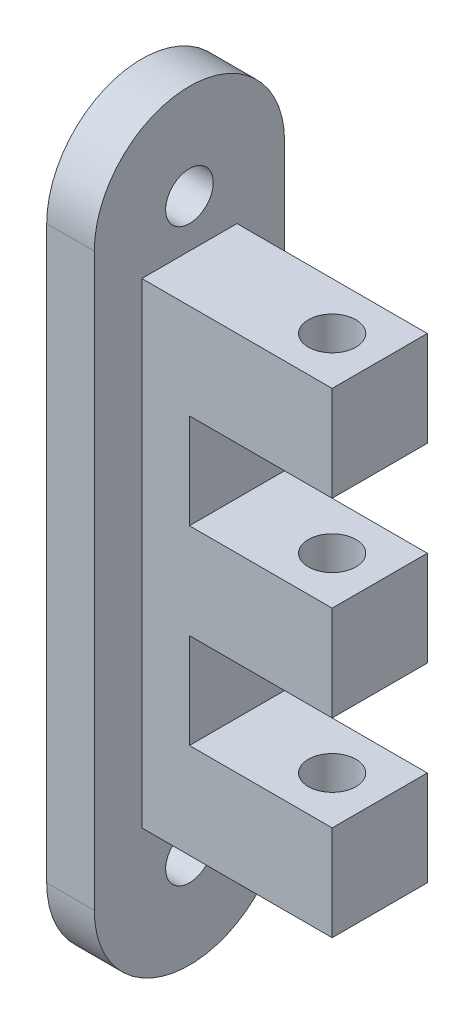
ISO-10303-21;
HEADER;
FILE_DESCRIPTION(('STEP AP214'),'2;1');
FILE_NAME('part.step','',(''),(''),'','','');
FILE_SCHEMA(('AUTOMOTIVE_DESIGN { 1 0 10303 214 1 1 1 1 }'));
ENDSEC;
DATA;
#1=APPLICATION_CONTEXT('core data for automotive mechanical design processes');
#2=APPLICATION_PROTOCOL_DEFINITION('international standard','automotive_design',2000,#1);
#3=PRODUCT_CONTEXT('',#1,'mechanical');
#4=PRODUCT('Part','Part','',(#3));
#5=PRODUCT_RELATED_PRODUCT_CATEGORY('part','',(#4));
#6=PRODUCT_DEFINITION_FORMATION('','',#4);
#7=PRODUCT_DEFINITION_CONTEXT('part definition',#1,'design');
#8=PRODUCT_DEFINITION('design','',#6,#7);
#9=PRODUCT_DEFINITION_SHAPE('','',#8);
#10=(LENGTH_UNIT() NAMED_UNIT(*) SI_UNIT(.MILLI.,.METRE.));
#11=(NAMED_UNIT(*) PLANE_ANGLE_UNIT() SI_UNIT($,.RADIAN.));
#12=(NAMED_UNIT(*) SI_UNIT($,.STERADIAN.) SOLID_ANGLE_UNIT());
#13=UNCERTAINTY_MEASURE_WITH_UNIT(LENGTH_MEASURE(1.E-05),#10,'distance_accuracy_value','');
#14=(GEOMETRIC_REPRESENTATION_CONTEXT(3) GLOBAL_UNCERTAINTY_ASSIGNED_CONTEXT((#13)) GLOBAL_UNIT_ASSIGNED_CONTEXT((#10,
#11,#12)) REPRESENTATION_CONTEXT('',''));
#15=CARTESIAN_POINT('',(0.,0.,0.));
#16=DIRECTION('',(0.,0.,1.));
#17=DIRECTION('',(1.,0.,0.));
#18=AXIS2_PLACEMENT_3D('',#15,#16,#17);
#19=CARTESIAN_POINT('',(0.,80.,-20.));
#20=DIRECTION('',(-1.,0.,0.));
#21=DIRECTION('',(0.,-1.,0.));
#22=AXIS2_PLACEMENT_3D('',#19,#20,#21);
#23=PLANE('',#22);
#24=DIRECTION('',(0.,-1.,0.));
#25=VECTOR('',#24,1.);
#26=CARTESIAN_POINT('',(0.,80.,20.));
#27=LINE('',#26,#25);
#28=CARTESIAN_POINT('',(0.,60.,20.));
#29=VERTEX_POINT('',#28);
#30=CARTESIAN_POINT('',(0.,-60.,20.));
#31=VERTEX_POINT('',#30);
#32=EDGE_CURVE('E177',#29,#31,#27,.T.);
#33=ORIENTED_EDGE('',*,*,#32,.T.);
#34=CARTESIAN_POINT('',(0.,-60.,0.));
#35=DIRECTION('',(-1.,0.,0.));
#36=DIRECTION('',(0.,-1.,0.));
#37=AXIS2_PLACEMENT_3D('',#34,#35,#36);
#38=CIRCLE('',#37,20.);
#39=CARTESIAN_POINT('',(0.,-60.,-20.));
#40=VERTEX_POINT('',#39);
#41=EDGE_CURVE('E11',#31,#40,#38,.F.);
#42=ORIENTED_EDGE('',*,*,#41,.T.);
#43=DIRECTION('',(0.,-1.,0.));
#44=VECTOR('',#43,1.);
#45=CARTESIAN_POINT('',(0.,80.,-20.));
#46=LINE('',#45,#44);
#47=CARTESIAN_POINT('',(0.,60.,-20.));
#48=VERTEX_POINT('',#47);
#49=EDGE_CURVE('E180',#48,#40,#46,.T.);
#50=ORIENTED_EDGE('',*,*,#49,.F.);
#51=CARTESIAN_POINT('',(0.,60.,0.));
#52=DIRECTION('',(-1.,0.,0.));
#53=DIRECTION('',(0.,-1.,0.));
#54=AXIS2_PLACEMENT_3D('',#51,#52,#53);
#55=CIRCLE('',#54,20.);
#56=EDGE_CURVE('E194',#48,#29,#55,.F.);
#57=ORIENTED_EDGE('',*,*,#56,.T.);
#58=EDGE_LOOP('',(#33,#42,#50,#57));
#59=FACE_BOUND('',#58,.T.);
#60=CARTESIAN_POINT('',(0.,60.,0.));
#61=DIRECTION('',(1.,0.,0.));
#62=DIRECTION('',(0.,1.,0.));
#63=AXIS2_PLACEMENT_3D('',#60,#61,#62);
#64=CIRCLE('',#63,5.);
#65=CARTESIAN_POINT('',(0.,65.,0.));
#66=VERTEX_POINT('',#65);
#67=EDGE_CURVE('E172',#66,#66,#64,.T.);
#68=ORIENTED_EDGE('',*,*,#67,.F.);
#69=EDGE_LOOP('',(#68));
#70=FACE_BOUND('',#69,.T.);
#71=CARTESIAN_POINT('',(0.,-60.,0.));
#72=DIRECTION('',(1.,0.,0.));
#73=DIRECTION('',(0.,1.,0.));
#74=AXIS2_PLACEMENT_3D('',#71,#72,#73);
#75=CIRCLE('',#74,5.);
#76=CARTESIAN_POINT('',(0.,-55.,0.));
#77=VERTEX_POINT('',#76);
#78=EDGE_CURVE('E162',#77,#77,#75,.T.);
#79=ORIENTED_EDGE('',*,*,#78,.F.);
#80=EDGE_LOOP('',(#79));
#81=FACE_BOUND('',#80,.T.);
#82=DIRECTION('',(0.,-1.,0.));
#83=VECTOR('',#82,1.);
#84=CARTESIAN_POINT('',(0.,-50.,10.));
#85=LINE('',#84,#83);
#86=CARTESIAN_POINT('',(0.,50.,10.));
#87=VERTEX_POINT('',#86);
#88=CARTESIAN_POINT('',(0.,-50.,10.));
#89=VERTEX_POINT('',#88);
#90=EDGE_CURVE('E148',#87,#89,#85,.T.);
#91=ORIENTED_EDGE('',*,*,#90,.F.);
#92=DIRECTION('',(0.,0.,-1.));
#93=VECTOR('',#92,1.);
#94=CARTESIAN_POINT('',(0.,50.,10.));
#95=LINE('',#94,#93);
#96=CARTESIAN_POINT('',(0.,50.,-10.));
#97=VERTEX_POINT('',#96);
#98=EDGE_CURVE('E449',#87,#97,#95,.T.);
#99=ORIENTED_EDGE('',*,*,#98,.T.);
#100=DIRECTION('',(0.,-1.,0.));
#101=VECTOR('',#100,1.);
#102=CARTESIAN_POINT('',(0.,-50.,-10.));
#103=LINE('',#102,#101);
#104=CARTESIAN_POINT('',(0.,-50.,-10.));
#105=VERTEX_POINT('',#104);
#106=EDGE_CURVE('E161',#97,#105,#103,.T.);
#107=ORIENTED_EDGE('',*,*,#106,.T.);
#108=DIRECTION('',(0.,0.,-1.));
#109=VECTOR('',#108,1.);
#110=CARTESIAN_POINT('',(0.,-50.,10.));
#111=LINE('',#110,#109);
#112=EDGE_CURVE('E45',#89,#105,#111,.T.);
#113=ORIENTED_EDGE('',*,*,#112,.F.);
#114=EDGE_LOOP('',(#91,#99,#107,#113));
#115=FACE_BOUND('',#114,.T.);
#116=ADVANCED_FACE('F30',(#59,#70,#81,#115),#23,.F.);
#117=CARTESIAN_POINT('',(-10.,-60.,0.));
#118=DIRECTION('',(-1.,0.,0.));
#119=DIRECTION('',(0.,-1.,0.));
#120=AXIS2_PLACEMENT_3D('',#117,#118,#119);
#121=CYLINDRICAL_SURFACE('',#120,20.);
#122=DIRECTION('',(-1.,0.,0.));
#123=VECTOR('',#122,1.);
#124=CARTESIAN_POINT('',(0.,-60.,20.));
#125=LINE('',#124,#123);
#126=CARTESIAN_POINT('',(-10.,-60.,20.));
#127=VERTEX_POINT('',#126);
#128=EDGE_CURVE('E199',#127,#31,#125,.F.);
#129=ORIENTED_EDGE('',*,*,#128,.F.);
#130=CARTESIAN_POINT('',(-10.,-60.,0.));
#131=DIRECTION('',(1.,0.,0.));
#132=DIRECTION('',(0.,1.,0.));
#133=AXIS2_PLACEMENT_3D('',#130,#131,#132);
#134=CIRCLE('',#133,20.);
#135=CARTESIAN_POINT('',(-10.,-60.,-20.));
#136=VERTEX_POINT('',#135);
#137=EDGE_CURVE('E38',#136,#127,#134,.F.);
#138=ORIENTED_EDGE('',*,*,#137,.F.);
#139=DIRECTION('',(1.,0.,0.));
#140=VECTOR('',#139,1.);
#141=CARTESIAN_POINT('',(-10.,-60.,-20.));
#142=LINE('',#141,#140);
#143=EDGE_CURVE('E202',#40,#136,#142,.F.);
#144=ORIENTED_EDGE('',*,*,#143,.F.);
#145=ORIENTED_EDGE('',*,*,#41,.F.);
#146=EDGE_LOOP('',(#129,#138,#144,#145));
#147=FACE_BOUND('',#146,.T.);
#148=ADVANCED_FACE('F32',(#147),#121,.T.);
#149=CARTESIAN_POINT('',(0.,60.,0.));
#150=DIRECTION('',(1.,0.,0.));
#151=DIRECTION('',(0.,1.,0.));
#152=AXIS2_PLACEMENT_3D('',#149,#150,#151);
#153=CYLINDRICAL_SURFACE('',#152,20.);
#154=DIRECTION('',(1.,0.,0.));
#155=VECTOR('',#154,1.);
#156=CARTESIAN_POINT('',(1.76365635428265E-13,60.,20.));
#157=LINE('',#156,#155);
#158=CARTESIAN_POINT('',(-9.99999999999997,60.,20.));
#159=VERTEX_POINT('',#158);
#160=EDGE_CURVE('E186',#29,#159,#157,.F.);
#161=ORIENTED_EDGE('',*,*,#160,.F.);
#162=ORIENTED_EDGE('',*,*,#56,.F.);
#163=DIRECTION('',(-1.,0.,0.));
#164=VECTOR('',#163,1.);
#165=CARTESIAN_POINT('',(0.,60.,-20.));
#166=LINE('',#165,#164);
#167=CARTESIAN_POINT('',(-9.99999999999997,60.,-20.));
#168=VERTEX_POINT('',#167);
#169=EDGE_CURVE('E191',#168,#48,#166,.F.);
#170=ORIENTED_EDGE('',*,*,#169,.F.);
#171=CARTESIAN_POINT('',(-9.99999999999998,60.,0.));
#172=DIRECTION('',(1.,0.,0.));
#173=DIRECTION('',(0.,1.,0.));
#174=AXIS2_PLACEMENT_3D('',#171,#172,#173);
#175=CIRCLE('',#174,20.);
#176=EDGE_CURVE('E196',#159,#168,#175,.F.);
#177=ORIENTED_EDGE('',*,*,#176,.F.);
#178=EDGE_LOOP('',(#161,#162,#170,#177));
#179=FACE_BOUND('',#178,.T.);
#180=ADVANCED_FACE('F216',(#179),#153,.T.);
#181=CARTESIAN_POINT('',(-9.99999999999997,80.,-20.));
#182=DIRECTION('',(1.,0.,0.));
#183=DIRECTION('',(0.,1.,0.));
#184=AXIS2_PLACEMENT_3D('',#181,#182,#183);
#185=PLANE('',#184);
#186=CARTESIAN_POINT('',(-10.0000000000001,-60.,0.));
#187=DIRECTION('',(1.,0.,0.));
#188=DIRECTION('',(0.,1.,0.));
#189=AXIS2_PLACEMENT_3D('',#186,#187,#188);
#190=CIRCLE('',#189,5.);
#191=CARTESIAN_POINT('',(-10.0000000000001,-55.,0.));
#192=VERTEX_POINT('',#191);
#193=EDGE_CURVE('E165',#192,#192,#190,.T.);
#194=ORIENTED_EDGE('',*,*,#193,.T.);
#195=EDGE_LOOP('',(#194));
#196=FACE_BOUND('',#195,.T.);
#197=CARTESIAN_POINT('',(-10.,60.,0.));
#198=DIRECTION('',(1.,0.,0.));
#199=DIRECTION('',(0.,1.,0.));
#200=AXIS2_PLACEMENT_3D('',#197,#198,#199);
#201=CIRCLE('',#200,5.);
#202=CARTESIAN_POINT('',(-10.,65.,0.));
#203=VERTEX_POINT('',#202);
#204=EDGE_CURVE('E174',#203,#203,#201,.T.);
#205=ORIENTED_EDGE('',*,*,#204,.T.);
#206=EDGE_LOOP('',(#205));
#207=FACE_BOUND('',#206,.T.);
#208=DIRECTION('',(0.,1.,0.));
#209=VECTOR('',#208,1.);
#210=CARTESIAN_POINT('',(-9.99999999999997,80.,-20.));
#211=LINE('',#210,#209);
#212=EDGE_CURVE('E183',#136,#168,#211,.T.);
#213=ORIENTED_EDGE('',*,*,#212,.F.);
#214=ORIENTED_EDGE('',*,*,#137,.T.);
#215=DIRECTION('',(0.,1.,0.));
#216=VECTOR('',#215,1.);
#217=CARTESIAN_POINT('',(-9.99999999999997,80.,20.));
#218=LINE('',#217,#216);
#219=EDGE_CURVE('E184',#127,#159,#218,.T.);
#220=ORIENTED_EDGE('',*,*,#219,.T.);
#221=ORIENTED_EDGE('',*,*,#176,.T.);
#222=EDGE_LOOP('',(#213,#214,#220,#221));
#223=FACE_BOUND('',#222,.T.);
#224=ADVANCED_FACE('F207',(#196,#207,#223),#185,.F.);
#225=CARTESIAN_POINT('',(0.,-80.,-20.));
#226=DIRECTION('',(0.,0.,-1.));
#227=DIRECTION('',(-1.,0.,0.));
#228=AXIS2_PLACEMENT_3D('',#225,#226,#227);
#229=PLANE('',#228);
#230=ORIENTED_EDGE('',*,*,#49,.T.);
#231=ORIENTED_EDGE('',*,*,#143,.T.);
#232=ORIENTED_EDGE('',*,*,#212,.T.);
#233=ORIENTED_EDGE('',*,*,#169,.T.);
#234=EDGE_LOOP('',(#230,#231,#232,#233));
#235=FACE_BOUND('',#234,.T.);
#236=ADVANCED_FACE('F219',(#235),#229,.T.);
#237=CARTESIAN_POINT('',(0.,-80.,20.));
#238=DIRECTION('',(0.,0.,-1.));
#239=DIRECTION('',(-1.,0.,0.));
#240=AXIS2_PLACEMENT_3D('',#237,#238,#239);
#241=PLANE('',#240);
#242=ORIENTED_EDGE('',*,*,#219,.F.);
#243=ORIENTED_EDGE('',*,*,#128,.T.);
#244=ORIENTED_EDGE('',*,*,#32,.F.);
#245=ORIENTED_EDGE('',*,*,#160,.T.);
#246=EDGE_LOOP('',(#242,#243,#244,#245));
#247=FACE_BOUND('',#246,.T.);
#248=ADVANCED_FACE('F213',(#247),#241,.F.);
#249=CARTESIAN_POINT('',(-10.,60.,0.));
#250=DIRECTION('',(1.,0.,0.));
#251=DIRECTION('',(0.,1.,0.));
#252=AXIS2_PLACEMENT_3D('',#249,#250,#251);
#253=CYLINDRICAL_SURFACE('',#252,5.);
#254=ORIENTED_EDGE('',*,*,#204,.F.);
#255=EDGE_LOOP('',(#254));
#256=FACE_BOUND('',#255,.T.);
#257=ORIENTED_EDGE('',*,*,#67,.T.);
#258=EDGE_LOOP('',(#257));
#259=FACE_BOUND('',#258,.T.);
#260=ADVANCED_FACE('F229',(#256,#259),#253,.F.);
#261=CARTESIAN_POINT('',(-10.0000000000001,-60.,0.));
#262=DIRECTION('',(1.,0.,0.));
#263=DIRECTION('',(0.,1.,0.));
#264=AXIS2_PLACEMENT_3D('',#261,#262,#263);
#265=CYLINDRICAL_SURFACE('',#264,5.);
#266=ORIENTED_EDGE('',*,*,#193,.F.);
#267=EDGE_LOOP('',(#266));
#268=FACE_BOUND('',#267,.T.);
#269=ORIENTED_EDGE('',*,*,#78,.T.);
#270=EDGE_LOOP('',(#269));
#271=FACE_BOUND('',#270,.T.);
#272=ADVANCED_FACE('F227',(#268,#271),#265,.F.);
#273=CARTESIAN_POINT('',(0.,-50.,10.));
#274=DIRECTION('',(0.,1.,0.));
#275=DIRECTION('',(0.,0.,1.));
#276=AXIS2_PLACEMENT_3D('',#273,#274,#275);
#277=PLANE('',#276);
#278=CARTESIAN_POINT('',(30.,-50.,0.));
#279=DIRECTION('',(0.,1.,0.));
#280=DIRECTION('',(0.,0.,1.));
#281=AXIS2_PLACEMENT_3D('',#278,#279,#280);
#282=CIRCLE('',#281,5.);
#283=CARTESIAN_POINT('',(30.,-50.,5.));
#284=VERTEX_POINT('',#283);
#285=EDGE_CURVE('E424',#284,#284,#282,.T.);
#286=ORIENTED_EDGE('',*,*,#285,.T.);
#287=EDGE_LOOP('',(#286));
#288=FACE_BOUND('',#287,.T.);
#289=DIRECTION('',(1.,0.,0.));
#290=VECTOR('',#289,1.);
#291=CARTESIAN_POINT('',(0.,-50.,-10.));
#292=LINE('',#291,#290);
#293=CARTESIAN_POINT('',(40.,-50.,-10.));
#294=VERTEX_POINT('',#293);
#295=EDGE_CURVE('E426',#105,#294,#292,.T.);
#296=ORIENTED_EDGE('',*,*,#295,.T.);
#297=DIRECTION('',(0.,0.,-1.));
#298=VECTOR('',#297,1.);
#299=CARTESIAN_POINT('',(40.,-50.,10.));
#300=LINE('',#299,#298);
#301=CARTESIAN_POINT('',(40.,-50.,10.));
#302=VERTEX_POINT('',#301);
#303=EDGE_CURVE('E144',#302,#294,#300,.T.);
#304=ORIENTED_EDGE('',*,*,#303,.F.);
#305=DIRECTION('',(1.,0.,0.));
#306=VECTOR('',#305,1.);
#307=CARTESIAN_POINT('',(0.,-50.,10.));
#308=LINE('',#307,#306);
#309=EDGE_CURVE('E140',#89,#302,#308,.T.);
#310=ORIENTED_EDGE('',*,*,#309,.F.);
#311=ORIENTED_EDGE('',*,*,#112,.T.);
#312=EDGE_LOOP('',(#296,#304,#310,#311));
#313=FACE_BOUND('',#312,.T.);
#314=ADVANCED_FACE('F142',(#288,#313),#277,.F.);
#315=CARTESIAN_POINT('',(40.,-50.,10.));
#316=DIRECTION('',(-1.,0.,0.));
#317=DIRECTION('',(0.,-1.,0.));
#318=AXIS2_PLACEMENT_3D('',#315,#316,#317);
#319=PLANE('',#318);
#320=DIRECTION('',(0.,1.,0.));
#321=VECTOR('',#320,1.);
#322=CARTESIAN_POINT('',(40.,-50.,-10.));
#323=LINE('',#322,#321);
#324=CARTESIAN_POINT('',(40.,-30.,-10.));
#325=VERTEX_POINT('',#324);
#326=EDGE_CURVE('E452',#294,#325,#323,.T.);
#327=ORIENTED_EDGE('',*,*,#326,.T.);
#328=DIRECTION('',(0.,0.,-1.));
#329=VECTOR('',#328,1.);
#330=CARTESIAN_POINT('',(40.,-30.,10.));
#331=LINE('',#330,#329);
#332=CARTESIAN_POINT('',(40.,-30.,10.));
#333=VERTEX_POINT('',#332);
#334=EDGE_CURVE('E167',#333,#325,#331,.T.);
#335=ORIENTED_EDGE('',*,*,#334,.F.);
#336=DIRECTION('',(0.,1.,0.));
#337=VECTOR('',#336,1.);
#338=CARTESIAN_POINT('',(40.,-50.,10.));
#339=LINE('',#338,#337);
#340=EDGE_CURVE('E147',#302,#333,#339,.T.);
#341=ORIENTED_EDGE('',*,*,#340,.F.);
#342=ORIENTED_EDGE('',*,*,#303,.T.);
#343=EDGE_LOOP('',(#327,#335,#341,#342));
#344=FACE_BOUND('',#343,.T.);
#345=ADVANCED_FACE('F236',(#344),#319,.F.);
#346=CARTESIAN_POINT('',(40.,-30.,10.));
#347=DIRECTION('',(0.,-1.,0.));
#348=DIRECTION('',(1.,0.,0.));
#349=AXIS2_PLACEMENT_3D('',#346,#347,#348);
#350=PLANE('',#349);
#351=CARTESIAN_POINT('',(30.,-30.,0.));
#352=DIRECTION('',(0.,-1.,0.));
#353=DIRECTION('',(1.,0.,0.));
#354=AXIS2_PLACEMENT_3D('',#351,#352,#353);
#355=CIRCLE('',#354,5.);
#356=CARTESIAN_POINT('',(35.,-30.,0.));
#357=VERTEX_POINT('',#356);
#358=EDGE_CURVE('E421',#357,#357,#355,.T.);
#359=ORIENTED_EDGE('',*,*,#358,.T.);
#360=EDGE_LOOP('',(#359));
#361=FACE_BOUND('',#360,.T.);
#362=DIRECTION('',(-1.,0.,0.));
#363=VECTOR('',#362,1.);
#364=CARTESIAN_POINT('',(40.,-30.,-10.));
#365=LINE('',#364,#363);
#366=CARTESIAN_POINT('',(10.,-30.,-10.));
#367=VERTEX_POINT('',#366);
#368=EDGE_CURVE('E454',#325,#367,#365,.T.);
#369=ORIENTED_EDGE('',*,*,#368,.T.);
#370=DIRECTION('',(0.,0.,-1.));
#371=VECTOR('',#370,1.);
#372=CARTESIAN_POINT('',(10.,-30.,10.));
#373=LINE('',#372,#371);
#374=CARTESIAN_POINT('',(10.,-30.,10.));
#375=VERTEX_POINT('',#374);
#376=EDGE_CURVE('E493',#375,#367,#373,.T.);
#377=ORIENTED_EDGE('',*,*,#376,.F.);
#378=DIRECTION('',(-1.,0.,0.));
#379=VECTOR('',#378,1.);
#380=CARTESIAN_POINT('',(40.,-30.,10.));
#381=LINE('',#380,#379);
#382=EDGE_CURVE('E433',#333,#375,#381,.T.);
#383=ORIENTED_EDGE('',*,*,#382,.F.);
#384=ORIENTED_EDGE('',*,*,#334,.T.);
#385=EDGE_LOOP('',(#369,#377,#383,#384));
#386=FACE_BOUND('',#385,.T.);
#387=ADVANCED_FACE('F274',(#361,#386),#350,.F.);
#388=CARTESIAN_POINT('',(10.,-30.,10.));
#389=DIRECTION('',(-1.,0.,0.));
#390=DIRECTION('',(0.,-1.,0.));
#391=AXIS2_PLACEMENT_3D('',#388,#389,#390);
#392=PLANE('',#391);
#393=DIRECTION('',(0.,1.,0.));
#394=VECTOR('',#393,1.);
#395=CARTESIAN_POINT('',(10.,-30.,-10.));
#396=LINE('',#395,#394);
#397=CARTESIAN_POINT('',(10.,-10.,-10.));
#398=VERTEX_POINT('',#397);
#399=EDGE_CURVE('E456',#367,#398,#396,.T.);
#400=ORIENTED_EDGE('',*,*,#399,.T.);
#401=DIRECTION('',(0.,0.,-1.));
#402=VECTOR('',#401,1.);
#403=CARTESIAN_POINT('',(10.,-10.,10.));
#404=LINE('',#403,#402);
#405=CARTESIAN_POINT('',(10.,-10.,10.));
#406=VERTEX_POINT('',#405);
#407=EDGE_CURVE('E490',#406,#398,#404,.T.);
#408=ORIENTED_EDGE('',*,*,#407,.F.);
#409=DIRECTION('',(0.,1.,0.));
#410=VECTOR('',#409,1.);
#411=CARTESIAN_POINT('',(10.,-30.,10.));
#412=LINE('',#411,#410);
#413=EDGE_CURVE('E435',#375,#406,#412,.T.);
#414=ORIENTED_EDGE('',*,*,#413,.F.);
#415=ORIENTED_EDGE('',*,*,#376,.T.);
#416=EDGE_LOOP('',(#400,#408,#414,#415));
#417=FACE_BOUND('',#416,.T.);
#418=ADVANCED_FACE('F281',(#417),#392,.F.);
#419=CARTESIAN_POINT('',(10.,-10.,10.));
#420=DIRECTION('',(0.,1.,0.));
#421=DIRECTION('',(0.,0.,1.));
#422=AXIS2_PLACEMENT_3D('',#419,#420,#421);
#423=PLANE('',#422);
#424=CARTESIAN_POINT('',(30.,-9.99999999999999,0.));
#425=DIRECTION('',(0.,1.,0.));
#426=DIRECTION('',(0.,0.,1.));
#427=AXIS2_PLACEMENT_3D('',#424,#425,#426);
#428=CIRCLE('',#427,5.);
#429=CARTESIAN_POINT('',(30.,-9.99999999999999,5.));
#430=VERTEX_POINT('',#429);
#431=EDGE_CURVE('E428',#430,#430,#428,.T.);
#432=ORIENTED_EDGE('',*,*,#431,.T.);
#433=EDGE_LOOP('',(#432));
#434=FACE_BOUND('',#433,.T.);
#435=DIRECTION('',(1.,0.,0.));
#436=VECTOR('',#435,1.);
#437=CARTESIAN_POINT('',(10.,-10.,-10.));
#438=LINE('',#437,#436);
#439=CARTESIAN_POINT('',(40.,-10.,-10.));
#440=VERTEX_POINT('',#439);
#441=EDGE_CURVE('E458',#398,#440,#438,.T.);
#442=ORIENTED_EDGE('',*,*,#441,.T.);
#443=DIRECTION('',(0.,0.,-1.));
#444=VECTOR('',#443,1.);
#445=CARTESIAN_POINT('',(40.,-10.,10.));
#446=LINE('',#445,#444);
#447=CARTESIAN_POINT('',(40.,-10.,10.));
#448=VERTEX_POINT('',#447);
#449=EDGE_CURVE('E487',#448,#440,#446,.T.);
#450=ORIENTED_EDGE('',*,*,#449,.F.);
#451=DIRECTION('',(1.,0.,0.));
#452=VECTOR('',#451,1.);
#453=CARTESIAN_POINT('',(10.,-10.,10.));
#454=LINE('',#453,#452);
#455=EDGE_CURVE('E437',#406,#448,#454,.T.);
#456=ORIENTED_EDGE('',*,*,#455,.F.);
#457=ORIENTED_EDGE('',*,*,#407,.T.);
#458=EDGE_LOOP('',(#442,#450,#456,#457));
#459=FACE_BOUND('',#458,.T.);
#460=ADVANCED_FACE('F286',(#434,#459),#423,.F.);
#461=CARTESIAN_POINT('',(40.,10.,10.));
#462=DIRECTION('',(-1.,0.,0.));
#463=DIRECTION('',(0.,0.,1.));
#464=AXIS2_PLACEMENT_3D('',#461,#462,#463);
#465=PLANE('',#464);
#466=DIRECTION('',(0.,1.,0.));
#467=VECTOR('',#466,1.);
#468=CARTESIAN_POINT('',(40.,10.,-10.));
#469=LINE('',#468,#467);
#470=CARTESIAN_POINT('',(40.,10.,-10.));
#471=VERTEX_POINT('',#470);
#472=EDGE_CURVE('E460',#440,#471,#469,.T.);
#473=ORIENTED_EDGE('',*,*,#472,.T.);
#474=DIRECTION('',(0.,0.,-1.));
#475=VECTOR('',#474,1.);
#476=CARTESIAN_POINT('',(40.,10.,10.));
#477=LINE('',#476,#475);
#478=CARTESIAN_POINT('',(40.,10.,10.));
#479=VERTEX_POINT('',#478);
#480=EDGE_CURVE('E484',#479,#471,#477,.T.);
#481=ORIENTED_EDGE('',*,*,#480,.F.);
#482=DIRECTION('',(0.,1.,0.));
#483=VECTOR('',#482,1.);
#484=CARTESIAN_POINT('',(40.,10.,10.));
#485=LINE('',#484,#483);
#486=EDGE_CURVE('E439',#448,#479,#485,.T.);
#487=ORIENTED_EDGE('',*,*,#486,.F.);
#488=ORIENTED_EDGE('',*,*,#449,.T.);
#489=EDGE_LOOP('',(#473,#481,#487,#488));
#490=FACE_BOUND('',#489,.T.);
#491=ADVANCED_FACE('F294',(#490),#465,.F.);
#492=CARTESIAN_POINT('',(10.,10.,10.));
#493=DIRECTION('',(0.,-1.,0.));
#494=DIRECTION('',(0.,0.,-1.));
#495=AXIS2_PLACEMENT_3D('',#492,#493,#494);
#496=PLANE('',#495);
#497=CARTESIAN_POINT('',(30.,9.99999999999999,0.));
#498=DIRECTION('',(0.,-1.,0.));
#499=DIRECTION('',(0.,0.,-1.));
#500=AXIS2_PLACEMENT_3D('',#497,#498,#499);
#501=CIRCLE('',#500,5.);
#502=CARTESIAN_POINT('',(30.,9.99999999999999,-5.));
#503=VERTEX_POINT('',#502);
#504=EDGE_CURVE('E530',#503,#503,#501,.T.);
#505=ORIENTED_EDGE('',*,*,#504,.T.);
#506=EDGE_LOOP('',(#505));
#507=FACE_BOUND('',#506,.T.);
#508=DIRECTION('',(-1.,0.,0.));
#509=VECTOR('',#508,1.);
#510=CARTESIAN_POINT('',(10.,10.,-10.));
#511=LINE('',#510,#509);
#512=CARTESIAN_POINT('',(10.,10.,-10.));
#513=VERTEX_POINT('',#512);
#514=EDGE_CURVE('E462',#471,#513,#511,.T.);
#515=ORIENTED_EDGE('',*,*,#514,.T.);
#516=DIRECTION('',(0.,0.,-1.));
#517=VECTOR('',#516,1.);
#518=CARTESIAN_POINT('',(10.,10.,10.));
#519=LINE('',#518,#517);
#520=CARTESIAN_POINT('',(10.,10.,10.));
#521=VERTEX_POINT('',#520);
#522=EDGE_CURVE('E481',#521,#513,#519,.T.);
#523=ORIENTED_EDGE('',*,*,#522,.F.);
#524=DIRECTION('',(-1.,0.,0.));
#525=VECTOR('',#524,1.);
#526=CARTESIAN_POINT('',(10.,10.,10.));
#527=LINE('',#526,#525);
#528=EDGE_CURVE('E441',#479,#521,#527,.T.);
#529=ORIENTED_EDGE('',*,*,#528,.F.);
#530=ORIENTED_EDGE('',*,*,#480,.T.);
#531=EDGE_LOOP('',(#515,#523,#529,#530));
#532=FACE_BOUND('',#531,.T.);
#533=ADVANCED_FACE('F299',(#507,#532),#496,.F.);
#534=CARTESIAN_POINT('',(10.,30.,10.));
#535=DIRECTION('',(-1.,0.,0.));
#536=DIRECTION('',(0.,-1.,0.));
#537=AXIS2_PLACEMENT_3D('',#534,#535,#536);
#538=PLANE('',#537);
#539=DIRECTION('',(0.,1.,0.));
#540=VECTOR('',#539,1.);
#541=CARTESIAN_POINT('',(10.,30.,-10.));
#542=LINE('',#541,#540);
#543=CARTESIAN_POINT('',(10.,30.,-10.));
#544=VERTEX_POINT('',#543);
#545=EDGE_CURVE('E464',#513,#544,#542,.T.);
#546=ORIENTED_EDGE('',*,*,#545,.T.);
#547=DIRECTION('',(0.,0.,-1.));
#548=VECTOR('',#547,1.);
#549=CARTESIAN_POINT('',(10.,30.,10.));
#550=LINE('',#549,#548);
#551=CARTESIAN_POINT('',(10.,30.,10.));
#552=VERTEX_POINT('',#551);
#553=EDGE_CURVE('E478',#552,#544,#550,.T.);
#554=ORIENTED_EDGE('',*,*,#553,.F.);
#555=DIRECTION('',(0.,1.,0.));
#556=VECTOR('',#555,1.);
#557=CARTESIAN_POINT('',(10.,30.,10.));
#558=LINE('',#557,#556);
#559=EDGE_CURVE('E443',#521,#552,#558,.T.);
#560=ORIENTED_EDGE('',*,*,#559,.F.);
#561=ORIENTED_EDGE('',*,*,#522,.T.);
#562=EDGE_LOOP('',(#546,#554,#560,#561));
#563=FACE_BOUND('',#562,.T.);
#564=ADVANCED_FACE('F307',(#563),#538,.F.);
#565=CARTESIAN_POINT('',(40.,30.,10.));
#566=DIRECTION('',(0.,1.,0.));
#567=DIRECTION('',(-1.,0.,0.));
#568=AXIS2_PLACEMENT_3D('',#565,#566,#567);
#569=PLANE('',#568);
#570=CARTESIAN_POINT('',(30.,30.,0.));
#571=DIRECTION('',(0.,1.,0.));
#572=DIRECTION('',(-1.,0.,0.));
#573=AXIS2_PLACEMENT_3D('',#570,#571,#572);
#574=CIRCLE('',#573,5.);
#575=CARTESIAN_POINT('',(25.,30.,0.));
#576=VERTEX_POINT('',#575);
#577=EDGE_CURVE('E533',#576,#576,#574,.T.);
#578=ORIENTED_EDGE('',*,*,#577,.T.);
#579=EDGE_LOOP('',(#578));
#580=FACE_BOUND('',#579,.T.);
#581=DIRECTION('',(1.,0.,0.));
#582=VECTOR('',#581,1.);
#583=CARTESIAN_POINT('',(40.,30.,-10.));
#584=LINE('',#583,#582);
#585=CARTESIAN_POINT('',(40.,30.,-10.));
#586=VERTEX_POINT('',#585);
#587=EDGE_CURVE('E466',#544,#586,#584,.T.);
#588=ORIENTED_EDGE('',*,*,#587,.T.);
#589=DIRECTION('',(0.,0.,-1.));
#590=VECTOR('',#589,1.);
#591=CARTESIAN_POINT('',(40.,30.,10.));
#592=LINE('',#591,#590);
#593=CARTESIAN_POINT('',(40.,30.,10.));
#594=VERTEX_POINT('',#593);
#595=EDGE_CURVE('E475',#594,#586,#592,.T.);
#596=ORIENTED_EDGE('',*,*,#595,.F.);
#597=DIRECTION('',(1.,0.,0.));
#598=VECTOR('',#597,1.);
#599=CARTESIAN_POINT('',(40.,30.,10.));
#600=LINE('',#599,#598);
#601=EDGE_CURVE('E445',#552,#594,#600,.T.);
#602=ORIENTED_EDGE('',*,*,#601,.F.);
#603=ORIENTED_EDGE('',*,*,#553,.T.);
#604=EDGE_LOOP('',(#588,#596,#602,#603));
#605=FACE_BOUND('',#604,.T.);
#606=ADVANCED_FACE('F312',(#580,#605),#569,.F.);
#607=CARTESIAN_POINT('',(40.,50.,10.));
#608=DIRECTION('',(-1.,0.,0.));
#609=DIRECTION('',(0.,-1.,0.));
#610=AXIS2_PLACEMENT_3D('',#607,#608,#609);
#611=PLANE('',#610);
#612=DIRECTION('',(0.,1.,0.));
#613=VECTOR('',#612,1.);
#614=CARTESIAN_POINT('',(40.,50.,-10.));
#615=LINE('',#614,#613);
#616=CARTESIAN_POINT('',(40.,50.,-10.));
#617=VERTEX_POINT('',#616);
#618=EDGE_CURVE('E468',#586,#617,#615,.T.);
#619=ORIENTED_EDGE('',*,*,#618,.T.);
#620=DIRECTION('',(0.,0.,-1.));
#621=VECTOR('',#620,1.);
#622=CARTESIAN_POINT('',(40.,50.,10.));
#623=LINE('',#622,#621);
#624=CARTESIAN_POINT('',(40.,50.,10.));
#625=VERTEX_POINT('',#624);
#626=EDGE_CURVE('E472',#625,#617,#623,.T.);
#627=ORIENTED_EDGE('',*,*,#626,.F.);
#628=DIRECTION('',(0.,1.,0.));
#629=VECTOR('',#628,1.);
#630=CARTESIAN_POINT('',(40.,50.,10.));
#631=LINE('',#630,#629);
#632=EDGE_CURVE('E447',#594,#625,#631,.T.);
#633=ORIENTED_EDGE('',*,*,#632,.F.);
#634=ORIENTED_EDGE('',*,*,#595,.T.);
#635=EDGE_LOOP('',(#619,#627,#633,#634));
#636=FACE_BOUND('',#635,.T.);
#637=ADVANCED_FACE('F320',(#636),#611,.F.);
#638=CARTESIAN_POINT('',(0.,50.,10.));
#639=DIRECTION('',(0.,-1.,0.));
#640=DIRECTION('',(0.,0.,-1.));
#641=AXIS2_PLACEMENT_3D('',#638,#639,#640);
#642=PLANE('',#641);
#643=CARTESIAN_POINT('',(30.,50.,0.));
#644=DIRECTION('',(0.,1.,0.));
#645=DIRECTION('',(0.,0.,1.));
#646=AXIS2_PLACEMENT_3D('',#643,#644,#645);
#647=CIRCLE('',#646,5.);
#648=CARTESIAN_POINT('',(30.,50.,5.));
#649=VERTEX_POINT('',#648);
#650=EDGE_CURVE('E536',#649,#649,#647,.T.);
#651=ORIENTED_EDGE('',*,*,#650,.F.);
#652=EDGE_LOOP('',(#651));
#653=FACE_BOUND('',#652,.T.);
#654=DIRECTION('',(-1.,0.,0.));
#655=VECTOR('',#654,1.);
#656=CARTESIAN_POINT('',(0.,50.,-10.));
#657=LINE('',#656,#655);
#658=EDGE_CURVE('E157',#617,#97,#657,.T.);
#659=ORIENTED_EDGE('',*,*,#658,.T.);
#660=ORIENTED_EDGE('',*,*,#98,.F.);
#661=DIRECTION('',(-1.,0.,0.));
#662=VECTOR('',#661,1.);
#663=CARTESIAN_POINT('',(0.,50.,10.));
#664=LINE('',#663,#662);
#665=EDGE_CURVE('E153',#625,#87,#664,.T.);
#666=ORIENTED_EDGE('',*,*,#665,.F.);
#667=ORIENTED_EDGE('',*,*,#626,.T.);
#668=EDGE_LOOP('',(#659,#660,#666,#667));
#669=FACE_BOUND('',#668,.T.);
#670=ADVANCED_FACE('F325',(#653,#669),#642,.F.);
#671=CARTESIAN_POINT('',(0.,50.,10.));
#672=DIRECTION('',(0.,0.,-1.));
#673=DIRECTION('',(-1.,0.,0.));
#674=AXIS2_PLACEMENT_3D('',#671,#672,#673);
#675=PLANE('',#674);
#676=ORIENTED_EDGE('',*,*,#90,.T.);
#677=ORIENTED_EDGE('',*,*,#309,.T.);
#678=ORIENTED_EDGE('',*,*,#340,.T.);
#679=ORIENTED_EDGE('',*,*,#382,.T.);
#680=ORIENTED_EDGE('',*,*,#413,.T.);
#681=ORIENTED_EDGE('',*,*,#455,.T.);
#682=ORIENTED_EDGE('',*,*,#486,.T.);
#683=ORIENTED_EDGE('',*,*,#528,.T.);
#684=ORIENTED_EDGE('',*,*,#559,.T.);
#685=ORIENTED_EDGE('',*,*,#601,.T.);
#686=ORIENTED_EDGE('',*,*,#632,.T.);
#687=ORIENTED_EDGE('',*,*,#665,.T.);
#688=EDGE_LOOP('',(#676,#677,#678,#679,#680,#681,#682,#683,#684,#685,#686,#687));
#689=FACE_BOUND('',#688,.T.);
#690=ADVANCED_FACE('F151',(#689),#675,.F.);
#691=CARTESIAN_POINT('',(0.,50.,-10.));
#692=DIRECTION('',(0.,0.,-1.));
#693=DIRECTION('',(-1.,0.,0.));
#694=AXIS2_PLACEMENT_3D('',#691,#692,#693);
#695=PLANE('',#694);
#696=ORIENTED_EDGE('',*,*,#106,.F.);
#697=ORIENTED_EDGE('',*,*,#658,.F.);
#698=ORIENTED_EDGE('',*,*,#618,.F.);
#699=ORIENTED_EDGE('',*,*,#587,.F.);
#700=ORIENTED_EDGE('',*,*,#545,.F.);
#701=ORIENTED_EDGE('',*,*,#514,.F.);
#702=ORIENTED_EDGE('',*,*,#472,.F.);
#703=ORIENTED_EDGE('',*,*,#441,.F.);
#704=ORIENTED_EDGE('',*,*,#399,.F.);
#705=ORIENTED_EDGE('',*,*,#368,.F.);
#706=ORIENTED_EDGE('',*,*,#326,.F.);
#707=ORIENTED_EDGE('',*,*,#295,.F.);
#708=EDGE_LOOP('',(#696,#697,#698,#699,#700,#701,#702,#703,#704,#705,#706,#707));
#709=FACE_BOUND('',#708,.T.);
#710=ADVANCED_FACE('F337',(#709),#695,.T.);
#711=CARTESIAN_POINT('',(30.,-80.,0.));
#712=DIRECTION('',(0.,1.,0.));
#713=DIRECTION('',(0.,0.,1.));
#714=AXIS2_PLACEMENT_3D('',#711,#712,#713);
#715=CYLINDRICAL_SURFACE('',#714,5.);
#716=ORIENTED_EDGE('',*,*,#650,.T.);
#717=EDGE_LOOP('',(#716));
#718=FACE_BOUND('',#717,.T.);
#719=ORIENTED_EDGE('',*,*,#577,.F.);
#720=EDGE_LOOP('',(#719));
#721=FACE_BOUND('',#720,.T.);
#722=ADVANCED_FACE('F346',(#718,#721),#715,.F.);
#723=ORIENTED_EDGE('',*,*,#504,.F.);
#724=EDGE_LOOP('',(#723));
#725=FACE_BOUND('',#724,.T.);
#726=ORIENTED_EDGE('',*,*,#431,.F.);
#727=EDGE_LOOP('',(#726));
#728=FACE_BOUND('',#727,.T.);
#729=ADVANCED_FACE('F396',(#725,#728),#715,.F.);
#730=ORIENTED_EDGE('',*,*,#358,.F.);
#731=EDGE_LOOP('',(#730));
#732=FACE_BOUND('',#731,.T.);
#733=ORIENTED_EDGE('',*,*,#285,.F.);
#734=EDGE_LOOP('',(#733));
#735=FACE_BOUND('',#734,.T.);
#736=ADVANCED_FACE('F399',(#732,#735),#715,.F.);
#737=CLOSED_SHELL('',(#116,#148,#180,#224,#236,#248,#260,#272,#314,#345,#387,#418,#460,#491,
#533,#564,#606,#637,#670,#690,#710,#722,#729,#736));
#738=MANIFOLD_SOLID_BREP('B2',#737);
#739=ADVANCED_BREP_SHAPE_REPRESENTATION('',(#18,#738),#14);
#740=SHAPE_DEFINITION_REPRESENTATION(#9,#739);
ENDSEC;
END-ISO-10303-21;
